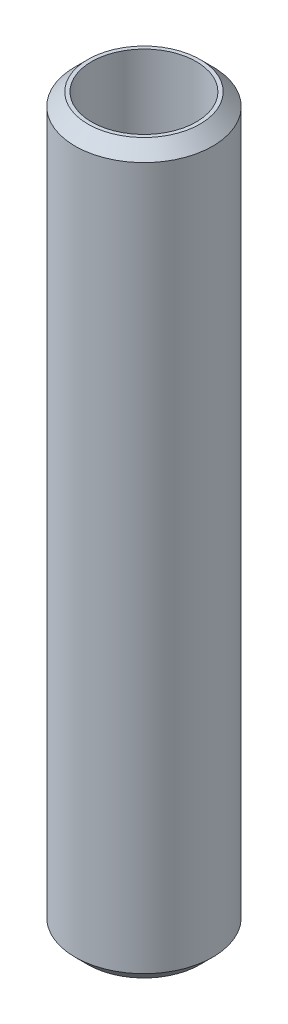
ISO-10303-21;
HEADER;
FILE_DESCRIPTION(('STEP AP214'),'2;1');
FILE_NAME('part.step','',(''),(''),'','','');
FILE_SCHEMA(('AUTOMOTIVE_DESIGN { 1 0 10303 214 1 1 1 1 }'));
ENDSEC;
DATA;
#1=APPLICATION_CONTEXT('core data for automotive mechanical design processes');
#2=APPLICATION_PROTOCOL_DEFINITION('international standard','automotive_design',2000,#1);
#3=PRODUCT_CONTEXT('',#1,'mechanical');
#4=PRODUCT('Part','Part','',(#3));
#5=PRODUCT_RELATED_PRODUCT_CATEGORY('part','',(#4));
#6=PRODUCT_DEFINITION_FORMATION('','',#4);
#7=PRODUCT_DEFINITION_CONTEXT('part definition',#1,'design');
#8=PRODUCT_DEFINITION('design','',#6,#7);
#9=PRODUCT_DEFINITION_SHAPE('','',#8);
#10=(LENGTH_UNIT() NAMED_UNIT(*) SI_UNIT(.MILLI.,.METRE.));
#11=(NAMED_UNIT(*) PLANE_ANGLE_UNIT() SI_UNIT($,.RADIAN.));
#12=(NAMED_UNIT(*) SI_UNIT($,.STERADIAN.) SOLID_ANGLE_UNIT());
#13=UNCERTAINTY_MEASURE_WITH_UNIT(LENGTH_MEASURE(1.E-05),#10,'distance_accuracy_value','');
#14=(GEOMETRIC_REPRESENTATION_CONTEXT(3) GLOBAL_UNCERTAINTY_ASSIGNED_CONTEXT((#13)) GLOBAL_UNIT_ASSIGNED_CONTEXT((#10,
#11,#12)) REPRESENTATION_CONTEXT('',''));
#15=CARTESIAN_POINT('',(0.,0.,0.));
#16=DIRECTION('',(0.,0.,1.));
#17=DIRECTION('',(1.,0.,0.));
#18=AXIS2_PLACEMENT_3D('',#15,#16,#17);
#19=CARTESIAN_POINT('',(0.,211.609010678267,0.));
#20=DIRECTION('',(0.,-1.,0.));
#21=DIRECTION('',(0.,0.,-1.));
#22=AXIS2_PLACEMENT_3D('',#19,#20,#21);
#23=CYLINDRICAL_SURFACE('',#22,20.);
#24=CARTESIAN_POINT('',(0.,207.904451000852,0.));
#25=DIRECTION('',(0.,1.,0.));
#26=DIRECTION('',(0.,0.,1.));
#27=AXIS2_PLACEMENT_3D('',#24,#25,#26);
#28=CIRCLE('',#27,20.);
#29=CARTESIAN_POINT('',(0.,207.904451000852,20.));
#30=VERTEX_POINT('',#29);
#31=EDGE_CURVE('E50',#30,#30,#28,.F.);
#32=ORIENTED_EDGE('',*,*,#31,.T.);
#33=EDGE_LOOP('',(#32));
#34=FACE_BOUND('',#33,.T.);
#35=CARTESIAN_POINT('',(0.,3.70455967741451,0.));
#36=DIRECTION('',(0.,1.,0.));
#37=DIRECTION('',(0.,0.,1.));
#38=AXIS2_PLACEMENT_3D('',#35,#36,#37);
#39=CIRCLE('',#38,20.);
#40=CARTESIAN_POINT('',(0.,3.70455967741451,20.));
#41=VERTEX_POINT('',#40);
#42=EDGE_CURVE('E51',#41,#41,#39,.T.);
#43=ORIENTED_EDGE('',*,*,#42,.T.);
#44=EDGE_LOOP('',(#43));
#45=FACE_BOUND('',#44,.T.);
#46=ADVANCED_FACE('F39',(#34,#45),#23,.T.);
#47=CARTESIAN_POINT('',(0.,211.609010678267,0.));
#48=DIRECTION('',(0.,1.,0.));
#49=DIRECTION('',(0.,0.,1.));
#50=AXIS2_PLACEMENT_3D('',#47,#48,#49);
#51=PLANE('',#50);
#52=CARTESIAN_POINT('',(0.,211.609010678267,0.));
#53=DIRECTION('',(0.,1.,0.));
#54=DIRECTION('',(0.,0.,1.));
#55=AXIS2_PLACEMENT_3D('',#52,#53,#54);
#56=CIRCLE('',#55,16.2954403225855);
#57=CARTESIAN_POINT('',(0.,211.609010678267,16.2954403225855));
#58=VERTEX_POINT('',#57);
#59=EDGE_CURVE('E54',#58,#58,#56,.T.);
#60=ORIENTED_EDGE('',*,*,#59,.T.);
#61=EDGE_LOOP('',(#60));
#62=FACE_BOUND('',#61,.T.);
#63=CARTESIAN_POINT('',(0.,211.609010678267,0.));
#64=DIRECTION('',(0.,1.,0.));
#65=DIRECTION('',(0.,0.,1.));
#66=AXIS2_PLACEMENT_3D('',#63,#64,#65);
#67=CIRCLE('',#66,15.2143538872128);
#68=CARTESIAN_POINT('',(0.,211.609010678267,15.2143538872128));
#69=VERTEX_POINT('',#68);
#70=EDGE_CURVE('E58',#69,#69,#67,.T.);
#71=ORIENTED_EDGE('',*,*,#70,.F.);
#72=EDGE_LOOP('',(#71));
#73=FACE_BOUND('',#72,.T.);
#74=ADVANCED_FACE('F69',(#62,#73),#51,.T.);
#75=CARTESIAN_POINT('',(0.,0.,0.));
#76=DIRECTION('',(0.,1.,0.));
#77=DIRECTION('',(0.,0.,1.));
#78=AXIS2_PLACEMENT_3D('',#75,#76,#77);
#79=PLANE('',#78);
#80=CARTESIAN_POINT('',(0.,0.,0.));
#81=DIRECTION('',(0.,1.,0.));
#82=DIRECTION('',(0.,0.,1.));
#83=AXIS2_PLACEMENT_3D('',#80,#81,#82);
#84=CIRCLE('',#83,16.2954403225854);
#85=CARTESIAN_POINT('',(0.,0.,16.2954403225854));
#86=VERTEX_POINT('',#85);
#87=EDGE_CURVE('E10',#86,#86,#84,.F.);
#88=ORIENTED_EDGE('',*,*,#87,.T.);
#89=EDGE_LOOP('',(#88));
#90=FACE_BOUND('',#89,.T.);
#91=CARTESIAN_POINT('',(0.,0.,0.));
#92=DIRECTION('',(0.,1.,0.));
#93=DIRECTION('',(0.,0.,1.));
#94=AXIS2_PLACEMENT_3D('',#91,#92,#93);
#95=CIRCLE('',#94,15.2143538872128);
#96=CARTESIAN_POINT('',(0.,0.,15.2143538872128));
#97=VERTEX_POINT('',#96);
#98=EDGE_CURVE('E63',#97,#97,#95,.T.);
#99=ORIENTED_EDGE('',*,*,#98,.T.);
#100=EDGE_LOOP('',(#99));
#101=FACE_BOUND('',#100,.T.);
#102=ADVANCED_FACE('F75',(#90,#101),#79,.F.);
#103=CARTESIAN_POINT('',(0.,211.609010678267,0.));
#104=DIRECTION('',(0.,-1.,0.));
#105=DIRECTION('',(0.,0.,-1.));
#106=AXIS2_PLACEMENT_3D('',#103,#104,#105);
#107=CYLINDRICAL_SURFACE('',#106,15.2143538872128);
#108=ORIENTED_EDGE('',*,*,#70,.T.);
#109=EDGE_LOOP('',(#108));
#110=FACE_BOUND('',#109,.T.);
#111=ORIENTED_EDGE('',*,*,#98,.F.);
#112=EDGE_LOOP('',(#111));
#113=FACE_BOUND('',#112,.T.);
#114=ADVANCED_FACE('F70',(#110,#113),#107,.F.);
#115=CARTESIAN_POINT('',(0.,211.609010678267,0.));
#116=DIRECTION('',(0.,-1.,0.));
#117=DIRECTION('',(0.,0.,-1.));
#118=AXIS2_PLACEMENT_3D('',#115,#116,#117);
#119=CONICAL_SURFACE('',#118,16.2954403225855,0.785398163397446);
#120=ORIENTED_EDGE('',*,*,#31,.F.);
#121=EDGE_LOOP('',(#120));
#122=FACE_BOUND('',#121,.T.);
#123=ORIENTED_EDGE('',*,*,#59,.F.);
#124=EDGE_LOOP('',(#123));
#125=FACE_BOUND('',#124,.T.);
#126=ADVANCED_FACE('F81',(#122,#125),#119,.T.);
#127=CARTESIAN_POINT('',(0.,3.70455967741451,0.));
#128=DIRECTION('',(0.,1.,0.));
#129=DIRECTION('',(0.,0.,1.));
#130=AXIS2_PLACEMENT_3D('',#127,#128,#129);
#131=CONICAL_SURFACE('',#130,20.,0.785398163397457);
#132=ORIENTED_EDGE('',*,*,#87,.F.);
#133=EDGE_LOOP('',(#132));
#134=FACE_BOUND('',#133,.T.);
#135=ORIENTED_EDGE('',*,*,#42,.F.);
#136=EDGE_LOOP('',(#135));
#137=FACE_BOUND('',#136,.T.);
#138=ADVANCED_FACE('F45',(#134,#137),#131,.T.);
#139=CLOSED_SHELL('',(#46,#74,#102,#114,#126,#138));
#140=MANIFOLD_SOLID_BREP('B2',#139);
#141=ADVANCED_BREP_SHAPE_REPRESENTATION('',(#18,#140),#14);
#142=SHAPE_DEFINITION_REPRESENTATION(#9,#141);
ENDSEC;
END-ISO-10303-21;
